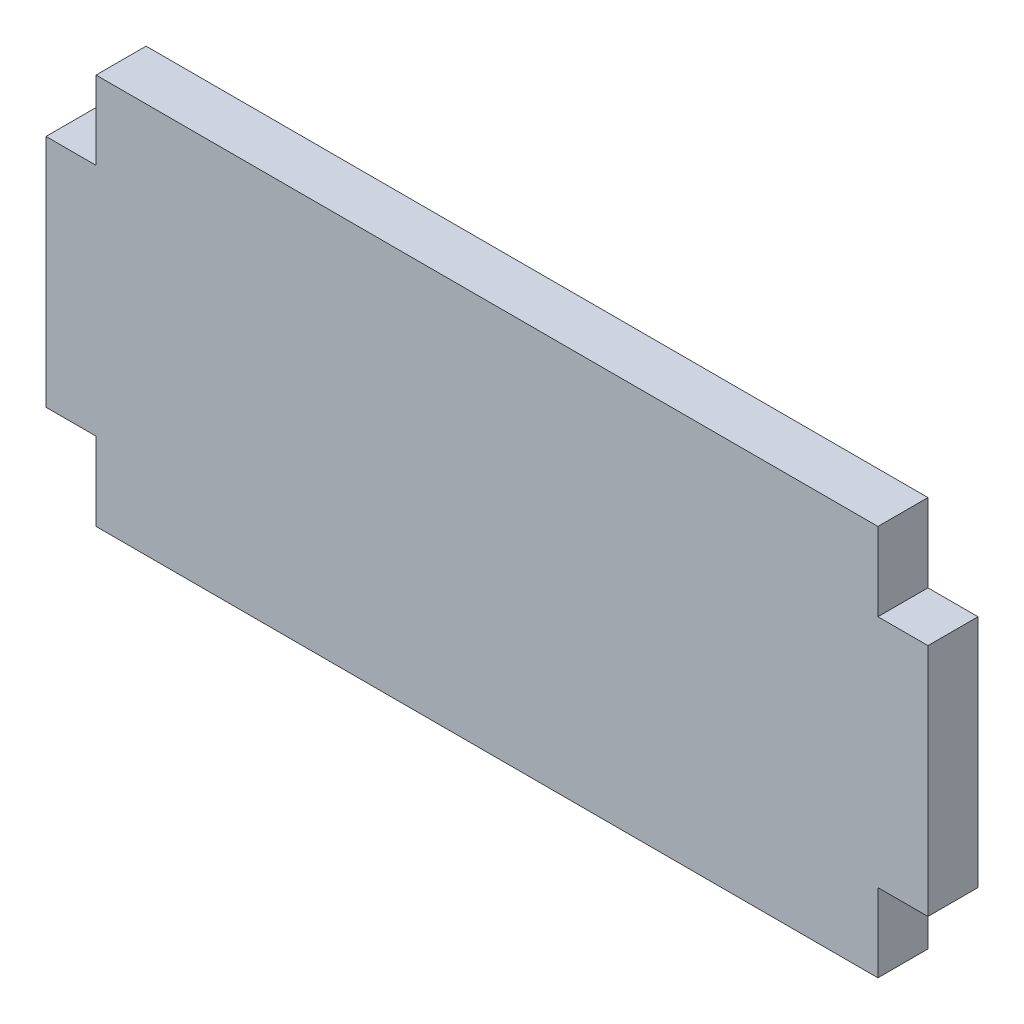
ISO-10303-21;
HEADER;
FILE_DESCRIPTION(('STEP AP214'),'2;1');
FILE_NAME('part.step','',(''),(''),'','','');
FILE_SCHEMA(('AUTOMOTIVE_DESIGN { 1 0 10303 214 1 1 1 1 }'));
ENDSEC;
DATA;
#1=APPLICATION_CONTEXT('core data for automotive mechanical design processes');
#2=APPLICATION_PROTOCOL_DEFINITION('international standard','automotive_design',2000,#1);
#3=PRODUCT_CONTEXT('',#1,'mechanical');
#4=PRODUCT('Part','Part','',(#3));
#5=PRODUCT_RELATED_PRODUCT_CATEGORY('part','',(#4));
#6=PRODUCT_DEFINITION_FORMATION('','',#4);
#7=PRODUCT_DEFINITION_CONTEXT('part definition',#1,'design');
#8=PRODUCT_DEFINITION('design','',#6,#7);
#9=PRODUCT_DEFINITION_SHAPE('','',#8);
#10=(LENGTH_UNIT() NAMED_UNIT(*) SI_UNIT(.MILLI.,.METRE.));
#11=(NAMED_UNIT(*) PLANE_ANGLE_UNIT() SI_UNIT($,.RADIAN.));
#12=(NAMED_UNIT(*) SI_UNIT($,.STERADIAN.) SOLID_ANGLE_UNIT());
#13=UNCERTAINTY_MEASURE_WITH_UNIT(LENGTH_MEASURE(1.E-05),#10,'distance_accuracy_value','');
#14=(GEOMETRIC_REPRESENTATION_CONTEXT(3) GLOBAL_UNCERTAINTY_ASSIGNED_CONTEXT((#13)) GLOBAL_UNIT_ASSIGNED_CONTEXT((#10,
#11,#12)) REPRESENTATION_CONTEXT('',''));
#15=CARTESIAN_POINT('',(0.,0.,0.));
#16=DIRECTION('',(0.,0.,1.));
#17=DIRECTION('',(1.,0.,0.));
#18=AXIS2_PLACEMENT_3D('',#15,#16,#17);
#19=CARTESIAN_POINT('',(3.2,0.,3.2));
#20=DIRECTION('',(0.,-1.,0.));
#21=DIRECTION('',(0.,0.,-1.));
#22=AXIS2_PLACEMENT_3D('',#19,#20,#21);
#23=PLANE('',#22);
#24=DIRECTION('',(-1.,0.,0.));
#25=VECTOR('',#24,1.);
#26=CARTESIAN_POINT('',(3.2,0.,0.));
#27=LINE('',#26,#25);
#28=CARTESIAN_POINT('',(3.2,0.,0.));
#29=VERTEX_POINT('',#28);
#30=CARTESIAN_POINT('',(0.,0.,0.));
#31=VERTEX_POINT('',#30);
#32=EDGE_CURVE('E152',#29,#31,#27,.T.);
#33=ORIENTED_EDGE('',*,*,#32,.T.);
#34=DIRECTION('',(0.,0.,-1.));
#35=VECTOR('',#34,1.);
#36=CARTESIAN_POINT('',(0.,0.,3.2));
#37=LINE('',#36,#35);
#38=CARTESIAN_POINT('',(0.,0.,3.2));
#39=VERTEX_POINT('',#38);
#40=EDGE_CURVE('E11',#39,#31,#37,.T.);
#41=ORIENTED_EDGE('',*,*,#40,.F.);
#42=DIRECTION('',(-1.,0.,0.));
#43=VECTOR('',#42,1.);
#44=CARTESIAN_POINT('',(3.2,0.,3.2));
#45=LINE('',#44,#43);
#46=CARTESIAN_POINT('',(3.2,0.,3.2));
#47=VERTEX_POINT('',#46);
#48=EDGE_CURVE('E174',#47,#39,#45,.T.);
#49=ORIENTED_EDGE('',*,*,#48,.F.);
#50=DIRECTION('',(0.,0.,-1.));
#51=VECTOR('',#50,1.);
#52=CARTESIAN_POINT('',(3.2,0.,3.2));
#53=LINE('',#52,#51);
#54=EDGE_CURVE('E148',#47,#29,#53,.T.);
#55=ORIENTED_EDGE('',*,*,#54,.T.);
#56=EDGE_LOOP('',(#33,#41,#49,#55));
#57=FACE_BOUND('',#56,.T.);
#58=ADVANCED_FACE('F32',(#57),#23,.F.);
#59=CARTESIAN_POINT('',(0.,0.,3.2));
#60=DIRECTION('',(1.,0.,0.));
#61=DIRECTION('',(0.,1.,0.));
#62=AXIS2_PLACEMENT_3D('',#59,#60,#61);
#63=PLANE('',#62);
#64=DIRECTION('',(0.,-1.,0.));
#65=VECTOR('',#64,1.);
#66=CARTESIAN_POINT('',(0.,0.,0.));
#67=LINE('',#66,#65);
#68=CARTESIAN_POINT('',(0.,-15.,0.));
#69=VERTEX_POINT('',#68);
#70=EDGE_CURVE('E155',#31,#69,#67,.T.);
#71=ORIENTED_EDGE('',*,*,#70,.T.);
#72=DIRECTION('',(0.,0.,-1.));
#73=VECTOR('',#72,1.);
#74=CARTESIAN_POINT('',(0.,-15.,3.2));
#75=LINE('',#74,#73);
#76=CARTESIAN_POINT('',(0.,-15.,3.2));
#77=VERTEX_POINT('',#76);
#78=EDGE_CURVE('E40',#77,#69,#75,.T.);
#79=ORIENTED_EDGE('',*,*,#78,.F.);
#80=DIRECTION('',(0.,-1.,0.));
#81=VECTOR('',#80,1.);
#82=CARTESIAN_POINT('',(0.,0.,3.2));
#83=LINE('',#82,#81);
#84=EDGE_CURVE('E103',#39,#77,#83,.T.);
#85=ORIENTED_EDGE('',*,*,#84,.F.);
#86=ORIENTED_EDGE('',*,*,#40,.T.);
#87=EDGE_LOOP('',(#71,#79,#85,#86));
#88=FACE_BOUND('',#87,.T.);
#89=ADVANCED_FACE('F252',(#88),#63,.F.);
#90=CARTESIAN_POINT('',(0.,-15.,3.2));
#91=DIRECTION('',(0.,1.,0.));
#92=DIRECTION('',(0.,0.,1.));
#93=AXIS2_PLACEMENT_3D('',#90,#91,#92);
#94=PLANE('',#93);
#95=DIRECTION('',(1.,0.,0.));
#96=VECTOR('',#95,1.);
#97=CARTESIAN_POINT('',(0.,-15.,0.));
#98=LINE('',#97,#96);
#99=CARTESIAN_POINT('',(3.2,-15.,0.));
#100=VERTEX_POINT('',#99);
#101=EDGE_CURVE('E157',#69,#100,#98,.T.);
#102=ORIENTED_EDGE('',*,*,#101,.T.);
#103=DIRECTION('',(0.,0.,-1.));
#104=VECTOR('',#103,1.);
#105=CARTESIAN_POINT('',(3.2,-15.,3.2));
#106=LINE('',#105,#104);
#107=CARTESIAN_POINT('',(3.2,-15.,3.2));
#108=VERTEX_POINT('',#107);
#109=EDGE_CURVE('E193',#108,#100,#106,.T.);
#110=ORIENTED_EDGE('',*,*,#109,.F.);
#111=DIRECTION('',(1.,0.,0.));
#112=VECTOR('',#111,1.);
#113=CARTESIAN_POINT('',(0.,-15.,3.2));
#114=LINE('',#113,#112);
#115=EDGE_CURVE('E201',#77,#108,#114,.T.);
#116=ORIENTED_EDGE('',*,*,#115,.F.);
#117=ORIENTED_EDGE('',*,*,#78,.T.);
#118=EDGE_LOOP('',(#102,#110,#116,#117));
#119=FACE_BOUND('',#118,.T.);
#120=ADVANCED_FACE('F199',(#119),#94,.F.);
#121=CARTESIAN_POINT('',(3.2,-15.,3.2));
#122=DIRECTION('',(1.,0.,0.));
#123=DIRECTION('',(0.,1.,0.));
#124=AXIS2_PLACEMENT_3D('',#121,#122,#123);
#125=PLANE('',#124);
#126=DIRECTION('',(0.,-1.,0.));
#127=VECTOR('',#126,1.);
#128=CARTESIAN_POINT('',(3.2,-15.,0.));
#129=LINE('',#128,#127);
#130=CARTESIAN_POINT('',(3.2,-20.,0.));
#131=VERTEX_POINT('',#130);
#132=EDGE_CURVE('E159',#100,#131,#129,.T.);
#133=ORIENTED_EDGE('',*,*,#132,.T.);
#134=DIRECTION('',(0.,0.,-1.));
#135=VECTOR('',#134,1.);
#136=CARTESIAN_POINT('',(3.2,-20.,3.2));
#137=LINE('',#136,#135);
#138=CARTESIAN_POINT('',(3.2,-20.,3.2));
#139=VERTEX_POINT('',#138);
#140=EDGE_CURVE('E190',#139,#131,#137,.T.);
#141=ORIENTED_EDGE('',*,*,#140,.F.);
#142=DIRECTION('',(0.,-1.,0.));
#143=VECTOR('',#142,1.);
#144=CARTESIAN_POINT('',(3.2,-15.,3.2));
#145=LINE('',#144,#143);
#146=EDGE_CURVE('E219',#108,#139,#145,.T.);
#147=ORIENTED_EDGE('',*,*,#146,.F.);
#148=ORIENTED_EDGE('',*,*,#109,.T.);
#149=EDGE_LOOP('',(#133,#141,#147,#148));
#150=FACE_BOUND('',#149,.T.);
#151=ADVANCED_FACE('F210',(#150),#125,.F.);
#152=CARTESIAN_POINT('',(3.2,-20.,3.2));
#153=DIRECTION('',(0.,1.,0.));
#154=DIRECTION('',(0.,0.,1.));
#155=AXIS2_PLACEMENT_3D('',#152,#153,#154);
#156=PLANE('',#155);
#157=DIRECTION('',(1.,0.,0.));
#158=VECTOR('',#157,1.);
#159=CARTESIAN_POINT('',(3.2,-20.,0.));
#160=LINE('',#159,#158);
#161=CARTESIAN_POINT('',(53.2,-20.,0.));
#162=VERTEX_POINT('',#161);
#163=EDGE_CURVE('E161',#131,#162,#160,.T.);
#164=ORIENTED_EDGE('',*,*,#163,.T.);
#165=DIRECTION('',(0.,0.,-1.));
#166=VECTOR('',#165,1.);
#167=CARTESIAN_POINT('',(53.2,-20.,3.2));
#168=LINE('',#167,#166);
#169=CARTESIAN_POINT('',(53.2,-20.,3.2));
#170=VERTEX_POINT('',#169);
#171=EDGE_CURVE('E187',#170,#162,#168,.T.);
#172=ORIENTED_EDGE('',*,*,#171,.F.);
#173=DIRECTION('',(1.,0.,0.));
#174=VECTOR('',#173,1.);
#175=CARTESIAN_POINT('',(3.2,-20.,3.2));
#176=LINE('',#175,#174);
#177=EDGE_CURVE('E216',#139,#170,#176,.T.);
#178=ORIENTED_EDGE('',*,*,#177,.F.);
#179=ORIENTED_EDGE('',*,*,#140,.T.);
#180=EDGE_LOOP('',(#164,#172,#178,#179));
#181=FACE_BOUND('',#180,.T.);
#182=ADVANCED_FACE('F214',(#181),#156,.F.);
#183=CARTESIAN_POINT('',(53.2,-20.,3.2));
#184=DIRECTION('',(-1.,0.,0.));
#185=DIRECTION('',(0.,0.,1.));
#186=AXIS2_PLACEMENT_3D('',#183,#184,#185);
#187=PLANE('',#186);
#188=DIRECTION('',(0.,1.,0.));
#189=VECTOR('',#188,1.);
#190=CARTESIAN_POINT('',(53.2,-20.,0.));
#191=LINE('',#190,#189);
#192=CARTESIAN_POINT('',(53.2,-15.,0.));
#193=VERTEX_POINT('',#192);
#194=EDGE_CURVE('E163',#162,#193,#191,.T.);
#195=ORIENTED_EDGE('',*,*,#194,.T.);
#196=DIRECTION('',(0.,0.,-1.));
#197=VECTOR('',#196,1.);
#198=CARTESIAN_POINT('',(53.2,-15.,3.2));
#199=LINE('',#198,#197);
#200=CARTESIAN_POINT('',(53.2,-15.,3.2));
#201=VERTEX_POINT('',#200);
#202=EDGE_CURVE('E184',#201,#193,#199,.T.);
#203=ORIENTED_EDGE('',*,*,#202,.F.);
#204=DIRECTION('',(0.,1.,0.));
#205=VECTOR('',#204,1.);
#206=CARTESIAN_POINT('',(53.2,-20.,3.2));
#207=LINE('',#206,#205);
#208=EDGE_CURVE('E218',#170,#201,#207,.T.);
#209=ORIENTED_EDGE('',*,*,#208,.F.);
#210=ORIENTED_EDGE('',*,*,#171,.T.);
#211=EDGE_LOOP('',(#195,#203,#209,#210));
#212=FACE_BOUND('',#211,.T.);
#213=ADVANCED_FACE('F265',(#212),#187,.F.);
#214=CARTESIAN_POINT('',(53.2,-15.,3.2));
#215=DIRECTION('',(0.,1.,0.));
#216=DIRECTION('',(0.,0.,1.));
#217=AXIS2_PLACEMENT_3D('',#214,#215,#216);
#218=PLANE('',#217);
#219=DIRECTION('',(1.,0.,0.));
#220=VECTOR('',#219,1.);
#221=CARTESIAN_POINT('',(53.2,-15.,0.));
#222=LINE('',#221,#220);
#223=CARTESIAN_POINT('',(56.4,-15.,0.));
#224=VERTEX_POINT('',#223);
#225=EDGE_CURVE('E165',#193,#224,#222,.T.);
#226=ORIENTED_EDGE('',*,*,#225,.T.);
#227=DIRECTION('',(0.,0.,-1.));
#228=VECTOR('',#227,1.);
#229=CARTESIAN_POINT('',(56.4,-15.,3.2));
#230=LINE('',#229,#228);
#231=CARTESIAN_POINT('',(56.4,-15.,3.2));
#232=VERTEX_POINT('',#231);
#233=EDGE_CURVE('E181',#232,#224,#230,.T.);
#234=ORIENTED_EDGE('',*,*,#233,.F.);
#235=DIRECTION('',(1.,0.,0.));
#236=VECTOR('',#235,1.);
#237=CARTESIAN_POINT('',(53.2,-15.,3.2));
#238=LINE('',#237,#236);
#239=EDGE_CURVE('E221',#201,#232,#238,.T.);
#240=ORIENTED_EDGE('',*,*,#239,.F.);
#241=ORIENTED_EDGE('',*,*,#202,.T.);
#242=EDGE_LOOP('',(#226,#234,#240,#241));
#243=FACE_BOUND('',#242,.T.);
#244=ADVANCED_FACE('F268',(#243),#218,.F.);
#245=CARTESIAN_POINT('',(56.4,-15.,3.2));
#246=DIRECTION('',(-1.,0.,0.));
#247=DIRECTION('',(0.,0.,1.));
#248=AXIS2_PLACEMENT_3D('',#245,#246,#247);
#249=PLANE('',#248);
#250=DIRECTION('',(0.,1.,0.));
#251=VECTOR('',#250,1.);
#252=CARTESIAN_POINT('',(56.4,-15.,0.));
#253=LINE('',#252,#251);
#254=CARTESIAN_POINT('',(56.4,0.,0.));
#255=VERTEX_POINT('',#254);
#256=EDGE_CURVE('E167',#224,#255,#253,.T.);
#257=ORIENTED_EDGE('',*,*,#256,.T.);
#258=DIRECTION('',(0.,0.,-1.));
#259=VECTOR('',#258,1.);
#260=CARTESIAN_POINT('',(56.4,0.,3.2));
#261=LINE('',#260,#259);
#262=CARTESIAN_POINT('',(56.4,0.,3.2));
#263=VERTEX_POINT('',#262);
#264=EDGE_CURVE('E178',#263,#255,#261,.T.);
#265=ORIENTED_EDGE('',*,*,#264,.F.);
#266=DIRECTION('',(0.,1.,0.));
#267=VECTOR('',#266,1.);
#268=CARTESIAN_POINT('',(56.4,-15.,3.2));
#269=LINE('',#268,#267);
#270=EDGE_CURVE('E227',#232,#263,#269,.T.);
#271=ORIENTED_EDGE('',*,*,#270,.F.);
#272=ORIENTED_EDGE('',*,*,#233,.T.);
#273=EDGE_LOOP('',(#257,#265,#271,#272));
#274=FACE_BOUND('',#273,.T.);
#275=ADVANCED_FACE('F233',(#274),#249,.F.);
#276=CARTESIAN_POINT('',(56.4,0.,3.2));
#277=DIRECTION('',(0.,-1.,0.));
#278=DIRECTION('',(1.,0.,0.));
#279=AXIS2_PLACEMENT_3D('',#276,#277,#278);
#280=PLANE('',#279);
#281=DIRECTION('',(-1.,0.,0.));
#282=VECTOR('',#281,1.);
#283=CARTESIAN_POINT('',(56.4,0.,0.));
#284=LINE('',#283,#282);
#285=CARTESIAN_POINT('',(53.2,0.,0.));
#286=VERTEX_POINT('',#285);
#287=EDGE_CURVE('E169',#255,#286,#284,.T.);
#288=ORIENTED_EDGE('',*,*,#287,.T.);
#289=DIRECTION('',(0.,0.,-1.));
#290=VECTOR('',#289,1.);
#291=CARTESIAN_POINT('',(53.2,0.,3.2));
#292=LINE('',#291,#290);
#293=CARTESIAN_POINT('',(53.2,0.,3.2));
#294=VERTEX_POINT('',#293);
#295=EDGE_CURVE('E143',#294,#286,#292,.T.);
#296=ORIENTED_EDGE('',*,*,#295,.F.);
#297=DIRECTION('',(-1.,0.,0.));
#298=VECTOR('',#297,1.);
#299=CARTESIAN_POINT('',(56.4,0.,3.2));
#300=LINE('',#299,#298);
#301=EDGE_CURVE('E134',#263,#294,#300,.T.);
#302=ORIENTED_EDGE('',*,*,#301,.F.);
#303=ORIENTED_EDGE('',*,*,#264,.T.);
#304=EDGE_LOOP('',(#288,#296,#302,#303));
#305=FACE_BOUND('',#304,.T.);
#306=ADVANCED_FACE('F237',(#305),#280,.F.);
#307=CARTESIAN_POINT('',(53.2,0.,3.2));
#308=DIRECTION('',(-1.,0.,0.));
#309=DIRECTION('',(0.,0.,1.));
#310=AXIS2_PLACEMENT_3D('',#307,#308,#309);
#311=PLANE('',#310);
#312=DIRECTION('',(0.,1.,0.));
#313=VECTOR('',#312,1.);
#314=CARTESIAN_POINT('',(53.2,0.,0.));
#315=LINE('',#314,#313);
#316=CARTESIAN_POINT('',(53.2,5.,0.));
#317=VERTEX_POINT('',#316);
#318=EDGE_CURVE('E142',#286,#317,#315,.T.);
#319=ORIENTED_EDGE('',*,*,#318,.T.);
#320=DIRECTION('',(0.,0.,-1.));
#321=VECTOR('',#320,1.);
#322=CARTESIAN_POINT('',(53.2,5.,3.2));
#323=LINE('',#322,#321);
#324=CARTESIAN_POINT('',(53.2,5.,3.2));
#325=VERTEX_POINT('',#324);
#326=EDGE_CURVE('E139',#325,#317,#323,.T.);
#327=ORIENTED_EDGE('',*,*,#326,.F.);
#328=DIRECTION('',(0.,1.,0.));
#329=VECTOR('',#328,1.);
#330=CARTESIAN_POINT('',(53.2,0.,3.2));
#331=LINE('',#330,#329);
#332=EDGE_CURVE('E128',#294,#325,#331,.T.);
#333=ORIENTED_EDGE('',*,*,#332,.F.);
#334=ORIENTED_EDGE('',*,*,#295,.T.);
#335=EDGE_LOOP('',(#319,#327,#333,#334));
#336=FACE_BOUND('',#335,.T.);
#337=ADVANCED_FACE('F140',(#336),#311,.F.);
#338=CARTESIAN_POINT('',(53.2,5.,3.2));
#339=DIRECTION('',(0.,-1.,0.));
#340=DIRECTION('',(0.,0.,-1.));
#341=AXIS2_PLACEMENT_3D('',#338,#339,#340);
#342=PLANE('',#341);
#343=DIRECTION('',(-1.,0.,0.));
#344=VECTOR('',#343,1.);
#345=CARTESIAN_POINT('',(53.2,5.,0.));
#346=LINE('',#345,#344);
#347=CARTESIAN_POINT('',(3.2,5.,0.));
#348=VERTEX_POINT('',#347);
#349=EDGE_CURVE('E89',#317,#348,#346,.T.);
#350=ORIENTED_EDGE('',*,*,#349,.T.);
#351=DIRECTION('',(0.,0.,-1.));
#352=VECTOR('',#351,1.);
#353=CARTESIAN_POINT('',(3.2,5.,3.2));
#354=LINE('',#353,#352);
#355=CARTESIAN_POINT('',(3.2,5.,3.2));
#356=VERTEX_POINT('',#355);
#357=EDGE_CURVE('E144',#356,#348,#354,.T.);
#358=ORIENTED_EDGE('',*,*,#357,.F.);
#359=DIRECTION('',(-1.,0.,0.));
#360=VECTOR('',#359,1.);
#361=CARTESIAN_POINT('',(53.2,5.,3.2));
#362=LINE('',#361,#360);
#363=EDGE_CURVE('E132',#325,#356,#362,.T.);
#364=ORIENTED_EDGE('',*,*,#363,.F.);
#365=ORIENTED_EDGE('',*,*,#326,.T.);
#366=EDGE_LOOP('',(#350,#358,#364,#365));
#367=FACE_BOUND('',#366,.T.);
#368=ADVANCED_FACE('F146',(#367),#342,.F.);
#369=CARTESIAN_POINT('',(3.2,5.,3.2));
#370=DIRECTION('',(1.,0.,0.));
#371=DIRECTION('',(0.,1.,0.));
#372=AXIS2_PLACEMENT_3D('',#369,#370,#371);
#373=PLANE('',#372);
#374=DIRECTION('',(0.,-1.,0.));
#375=VECTOR('',#374,1.);
#376=CARTESIAN_POINT('',(3.2,5.,0.));
#377=LINE('',#376,#375);
#378=EDGE_CURVE('E95',#348,#29,#377,.T.);
#379=ORIENTED_EDGE('',*,*,#378,.T.);
#380=ORIENTED_EDGE('',*,*,#54,.F.);
#381=DIRECTION('',(0.,-1.,0.));
#382=VECTOR('',#381,1.);
#383=CARTESIAN_POINT('',(3.2,5.,3.2));
#384=LINE('',#383,#382);
#385=EDGE_CURVE('E48',#356,#47,#384,.T.);
#386=ORIENTED_EDGE('',*,*,#385,.F.);
#387=ORIENTED_EDGE('',*,*,#357,.T.);
#388=EDGE_LOOP('',(#379,#380,#386,#387));
#389=FACE_BOUND('',#388,.T.);
#390=ADVANCED_FACE('F241',(#389),#373,.F.);
#391=CARTESIAN_POINT('',(0.,0.,3.2));
#392=DIRECTION('',(0.,0.,1.));
#393=DIRECTION('',(1.,0.,0.));
#394=AXIS2_PLACEMENT_3D('',#391,#392,#393);
#395=PLANE('',#394);
#396=ORIENTED_EDGE('',*,*,#48,.T.);
#397=ORIENTED_EDGE('',*,*,#84,.T.);
#398=ORIENTED_EDGE('',*,*,#115,.T.);
#399=ORIENTED_EDGE('',*,*,#146,.T.);
#400=ORIENTED_EDGE('',*,*,#177,.T.);
#401=ORIENTED_EDGE('',*,*,#208,.T.);
#402=ORIENTED_EDGE('',*,*,#239,.T.);
#403=ORIENTED_EDGE('',*,*,#270,.T.);
#404=ORIENTED_EDGE('',*,*,#301,.T.);
#405=ORIENTED_EDGE('',*,*,#332,.T.);
#406=ORIENTED_EDGE('',*,*,#363,.T.);
#407=ORIENTED_EDGE('',*,*,#385,.T.);
#408=EDGE_LOOP('',(#396,#397,#398,#399,#400,#401,#402,#403,#404,#405,#406,#407));
#409=FACE_BOUND('',#408,.T.);
#410=ADVANCED_FACE('F130',(#409),#395,.T.);
#411=CARTESIAN_POINT('',(0.,0.,0.));
#412=DIRECTION('',(0.,0.,1.));
#413=DIRECTION('',(1.,0.,0.));
#414=AXIS2_PLACEMENT_3D('',#411,#412,#413);
#415=PLANE('',#414);
#416=ORIENTED_EDGE('',*,*,#32,.F.);
#417=ORIENTED_EDGE('',*,*,#378,.F.);
#418=ORIENTED_EDGE('',*,*,#349,.F.);
#419=ORIENTED_EDGE('',*,*,#318,.F.);
#420=ORIENTED_EDGE('',*,*,#287,.F.);
#421=ORIENTED_EDGE('',*,*,#256,.F.);
#422=ORIENTED_EDGE('',*,*,#225,.F.);
#423=ORIENTED_EDGE('',*,*,#194,.F.);
#424=ORIENTED_EDGE('',*,*,#163,.F.);
#425=ORIENTED_EDGE('',*,*,#132,.F.);
#426=ORIENTED_EDGE('',*,*,#101,.F.);
#427=ORIENTED_EDGE('',*,*,#70,.F.);
#428=EDGE_LOOP('',(#416,#417,#418,#419,#420,#421,#422,#423,#424,#425,#426,#427));
#429=FACE_BOUND('',#428,.T.);
#430=ADVANCED_FACE('F205',(#429),#415,.F.);
#431=CLOSED_SHELL('',(#58,#89,#120,#151,#182,#213,#244,#275,#306,#337,#368,#390,#410,#430));
#432=MANIFOLD_SOLID_BREP('B2',#431);
#433=ADVANCED_BREP_SHAPE_REPRESENTATION('',(#18,#432),#14);
#434=SHAPE_DEFINITION_REPRESENTATION(#9,#433);
ENDSEC;
END-ISO-10303-21;
